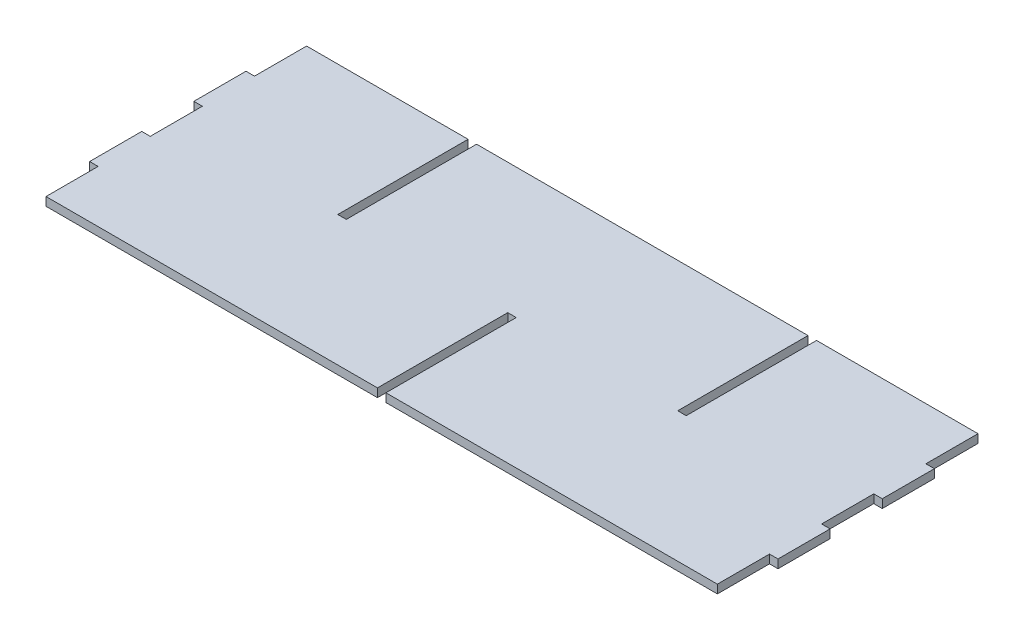
ISO-10303-21;
HEADER;
FILE_DESCRIPTION(('STEP AP214'),'2;1');
FILE_NAME('part.step','',(''),(''),'','','');
FILE_SCHEMA(('AUTOMOTIVE_DESIGN { 1 0 10303 214 1 1 1 1 }'));
ENDSEC;
DATA;
#1=APPLICATION_CONTEXT('core data for automotive mechanical design processes');
#2=APPLICATION_PROTOCOL_DEFINITION('international standard','automotive_design',2000,#1);
#3=PRODUCT_CONTEXT('',#1,'mechanical');
#4=PRODUCT('Part','Part','',(#3));
#5=PRODUCT_RELATED_PRODUCT_CATEGORY('part','',(#4));
#6=PRODUCT_DEFINITION_FORMATION('','',#4);
#7=PRODUCT_DEFINITION_CONTEXT('part definition',#1,'design');
#8=PRODUCT_DEFINITION('design','',#6,#7);
#9=PRODUCT_DEFINITION_SHAPE('','',#8);
#10=(LENGTH_UNIT() NAMED_UNIT(*) SI_UNIT(.MILLI.,.METRE.));
#11=(NAMED_UNIT(*) PLANE_ANGLE_UNIT() SI_UNIT($,.RADIAN.));
#12=(NAMED_UNIT(*) SI_UNIT($,.STERADIAN.) SOLID_ANGLE_UNIT());
#13=UNCERTAINTY_MEASURE_WITH_UNIT(LENGTH_MEASURE(1.E-05),#10,'distance_accuracy_value','');
#14=(GEOMETRIC_REPRESENTATION_CONTEXT(3) GLOBAL_UNCERTAINTY_ASSIGNED_CONTEXT((#13)) GLOBAL_UNIT_ASSIGNED_CONTEXT((#10,
#11,#12)) REPRESENTATION_CONTEXT('',''));
#15=CARTESIAN_POINT('',(0.,0.,0.));
#16=DIRECTION('',(0.,0.,1.));
#17=DIRECTION('',(1.,0.,0.));
#18=AXIS2_PLACEMENT_3D('',#15,#16,#17);
#19=CARTESIAN_POINT('',(118.5,1.5,-27.6));
#20=DIRECTION('',(-1.,0.,0.));
#21=DIRECTION('',(0.,0.,1.));
#22=AXIS2_PLACEMENT_3D('',#19,#20,#21);
#23=PLANE('',#22);
#24=DIRECTION('',(0.,0.,-1.));
#25=VECTOR('',#24,1.);
#26=CARTESIAN_POINT('',(118.5,-1.5,-27.6));
#27=LINE('',#26,#25);
#28=CARTESIAN_POINT('',(118.5,-1.5,-27.6));
#29=VERTEX_POINT('',#28);
#30=CARTESIAN_POINT('',(118.5,-1.5,-46.));
#31=VERTEX_POINT('',#30);
#32=EDGE_CURVE('E273',#29,#31,#27,.T.);
#33=ORIENTED_EDGE('',*,*,#32,.T.);
#34=DIRECTION('',(0.,-1.,0.));
#35=VECTOR('',#34,1.);
#36=CARTESIAN_POINT('',(118.5,1.5,-46.));
#37=LINE('',#36,#35);
#38=CARTESIAN_POINT('',(118.5,1.5,-46.));
#39=VERTEX_POINT('',#38);
#40=EDGE_CURVE('E11',#39,#31,#37,.T.);
#41=ORIENTED_EDGE('',*,*,#40,.F.);
#42=DIRECTION('',(0.,0.,-1.));
#43=VECTOR('',#42,1.);
#44=CARTESIAN_POINT('',(118.5,1.5,-27.6));
#45=LINE('',#44,#43);
#46=CARTESIAN_POINT('',(118.5,1.5,-27.6));
#47=VERTEX_POINT('',#46);
#48=EDGE_CURVE('E335',#47,#39,#45,.T.);
#49=ORIENTED_EDGE('',*,*,#48,.F.);
#50=DIRECTION('',(0.,-1.,0.));
#51=VECTOR('',#50,1.);
#52=CARTESIAN_POINT('',(118.5,1.5,-27.6));
#53=LINE('',#52,#51);
#54=EDGE_CURVE('E269',#47,#29,#53,.T.);
#55=ORIENTED_EDGE('',*,*,#54,.T.);
#56=EDGE_LOOP('',(#33,#41,#49,#55));
#57=FACE_BOUND('',#56,.T.);
#58=ADVANCED_FACE('F33',(#57),#23,.F.);
#59=CARTESIAN_POINT('',(61.5000000000003,1.5,-46.));
#60=DIRECTION('',(0.,0.,1.));
#61=DIRECTION('',(1.,0.,0.));
#62=AXIS2_PLACEMENT_3D('',#59,#60,#61);
#63=PLANE('',#62);
#64=DIRECTION('',(-1.,0.,0.));
#65=VECTOR('',#64,1.);
#66=CARTESIAN_POINT('',(61.5000000000003,-1.5,-46.));
#67=LINE('',#66,#65);
#68=CARTESIAN_POINT('',(61.5000000000003,-1.5,-46.));
#69=VERTEX_POINT('',#68);
#70=EDGE_CURVE('E276',#31,#69,#67,.T.);
#71=ORIENTED_EDGE('',*,*,#70,.T.);
#72=DIRECTION('',(0.,-1.,0.));
#73=VECTOR('',#72,1.);
#74=CARTESIAN_POINT('',(61.5000000000003,1.5,-46.));
#75=LINE('',#74,#73);
#76=CARTESIAN_POINT('',(61.5000000000003,1.5,-46.));
#77=VERTEX_POINT('',#76);
#78=EDGE_CURVE('E41',#77,#69,#75,.T.);
#79=ORIENTED_EDGE('',*,*,#78,.F.);
#80=DIRECTION('',(-1.,0.,0.));
#81=VECTOR('',#80,1.);
#82=CARTESIAN_POINT('',(61.5000000000003,1.5,-46.));
#83=LINE('',#82,#81);
#84=EDGE_CURVE('E164',#39,#77,#83,.T.);
#85=ORIENTED_EDGE('',*,*,#84,.F.);
#86=ORIENTED_EDGE('',*,*,#40,.T.);
#87=EDGE_LOOP('',(#71,#79,#85,#86));
#88=FACE_BOUND('',#87,.T.);
#89=ADVANCED_FACE('F513',(#88),#63,.F.);
#90=CARTESIAN_POINT('',(61.5000000000003,1.5,0.));
#91=DIRECTION('',(1.,0.,0.));
#92=DIRECTION('',(0.,0.,-1.));
#93=AXIS2_PLACEMENT_3D('',#90,#91,#92);
#94=PLANE('',#93);
#95=DIRECTION('',(0.,0.,1.));
#96=VECTOR('',#95,1.);
#97=CARTESIAN_POINT('',(61.5000000000003,-1.5,0.));
#98=LINE('',#97,#96);
#99=CARTESIAN_POINT('',(61.5000000000003,-1.5,0.));
#100=VERTEX_POINT('',#99);
#101=EDGE_CURVE('E278',#69,#100,#98,.T.);
#102=ORIENTED_EDGE('',*,*,#101,.T.);
#103=DIRECTION('',(0.,-1.,0.));
#104=VECTOR('',#103,1.);
#105=CARTESIAN_POINT('',(61.5000000000003,1.5,0.));
#106=LINE('',#105,#104);
#107=CARTESIAN_POINT('',(61.5000000000003,1.5,0.));
#108=VERTEX_POINT('',#107);
#109=EDGE_CURVE('E414',#108,#100,#106,.T.);
#110=ORIENTED_EDGE('',*,*,#109,.F.);
#111=DIRECTION('',(0.,0.,1.));
#112=VECTOR('',#111,1.);
#113=CARTESIAN_POINT('',(61.5000000000003,1.5,0.));
#114=LINE('',#113,#112);
#115=EDGE_CURVE('E422',#77,#108,#114,.T.);
#116=ORIENTED_EDGE('',*,*,#115,.F.);
#117=ORIENTED_EDGE('',*,*,#78,.T.);
#118=EDGE_LOOP('',(#102,#110,#116,#117));
#119=FACE_BOUND('',#118,.T.);
#120=ADVANCED_FACE('F420',(#119),#94,.F.);
#121=CARTESIAN_POINT('',(58.5000000000003,1.5,0.));
#122=DIRECTION('',(0.,0.,1.));
#123=DIRECTION('',(1.,0.,0.));
#124=AXIS2_PLACEMENT_3D('',#121,#122,#123);
#125=PLANE('',#124);
#126=DIRECTION('',(-1.,0.,0.));
#127=VECTOR('',#126,1.);
#128=CARTESIAN_POINT('',(58.5000000000003,-1.5,0.));
#129=LINE('',#128,#127);
#130=CARTESIAN_POINT('',(58.5000000000003,-1.5,0.));
#131=VERTEX_POINT('',#130);
#132=EDGE_CURVE('E280',#100,#131,#129,.T.);
#133=ORIENTED_EDGE('',*,*,#132,.T.);
#134=DIRECTION('',(0.,-1.,0.));
#135=VECTOR('',#134,1.);
#136=CARTESIAN_POINT('',(58.5000000000003,1.5,0.));
#137=LINE('',#136,#135);
#138=CARTESIAN_POINT('',(58.5000000000003,1.5,0.));
#139=VERTEX_POINT('',#138);
#140=EDGE_CURVE('E411',#139,#131,#137,.T.);
#141=ORIENTED_EDGE('',*,*,#140,.F.);
#142=DIRECTION('',(-1.,0.,0.));
#143=VECTOR('',#142,1.);
#144=CARTESIAN_POINT('',(58.5000000000003,1.5,0.));
#145=LINE('',#144,#143);
#146=EDGE_CURVE('E440',#108,#139,#145,.T.);
#147=ORIENTED_EDGE('',*,*,#146,.F.);
#148=ORIENTED_EDGE('',*,*,#109,.T.);
#149=EDGE_LOOP('',(#133,#141,#147,#148));
#150=FACE_BOUND('',#149,.T.);
#151=ADVANCED_FACE('F431',(#150),#125,.F.);
#152=CARTESIAN_POINT('',(58.5000000000003,1.5,-46.));
#153=DIRECTION('',(-1.,0.,0.));
#154=DIRECTION('',(0.,0.,1.));
#155=AXIS2_PLACEMENT_3D('',#152,#153,#154);
#156=PLANE('',#155);
#157=DIRECTION('',(0.,0.,-1.));
#158=VECTOR('',#157,1.);
#159=CARTESIAN_POINT('',(58.5000000000003,-1.5,-46.));
#160=LINE('',#159,#158);
#161=CARTESIAN_POINT('',(58.5000000000003,-1.5,-46.));
#162=VERTEX_POINT('',#161);
#163=EDGE_CURVE('E282',#131,#162,#160,.T.);
#164=ORIENTED_EDGE('',*,*,#163,.T.);
#165=DIRECTION('',(0.,-1.,0.));
#166=VECTOR('',#165,1.);
#167=CARTESIAN_POINT('',(58.5000000000003,1.5,-46.));
#168=LINE('',#167,#166);
#169=CARTESIAN_POINT('',(58.5000000000003,1.5,-46.));
#170=VERTEX_POINT('',#169);
#171=EDGE_CURVE('E408',#170,#162,#168,.T.);
#172=ORIENTED_EDGE('',*,*,#171,.F.);
#173=DIRECTION('',(0.,0.,-1.));
#174=VECTOR('',#173,1.);
#175=CARTESIAN_POINT('',(58.5000000000003,1.5,-46.));
#176=LINE('',#175,#174);
#177=EDGE_CURVE('E437',#139,#170,#176,.T.);
#178=ORIENTED_EDGE('',*,*,#177,.F.);
#179=ORIENTED_EDGE('',*,*,#140,.T.);
#180=EDGE_LOOP('',(#164,#172,#178,#179));
#181=FACE_BOUND('',#180,.T.);
#182=ADVANCED_FACE('F435',(#181),#156,.F.);
#183=CARTESIAN_POINT('',(-58.5000000000001,1.5,-46.));
#184=DIRECTION('',(0.,0.,1.));
#185=DIRECTION('',(1.,0.,0.));
#186=AXIS2_PLACEMENT_3D('',#183,#184,#185);
#187=PLANE('',#186);
#188=DIRECTION('',(-1.,0.,0.));
#189=VECTOR('',#188,1.);
#190=CARTESIAN_POINT('',(-58.5000000000001,-1.5,-46.));
#191=LINE('',#190,#189);
#192=CARTESIAN_POINT('',(-58.5000000000001,-1.5,-46.));
#193=VERTEX_POINT('',#192);
#194=EDGE_CURVE('E284',#162,#193,#191,.T.);
#195=ORIENTED_EDGE('',*,*,#194,.T.);
#196=DIRECTION('',(0.,-1.,0.));
#197=VECTOR('',#196,1.);
#198=CARTESIAN_POINT('',(-58.5000000000001,1.5,-46.));
#199=LINE('',#198,#197);
#200=CARTESIAN_POINT('',(-58.5000000000001,1.5,-46.));
#201=VERTEX_POINT('',#200);
#202=EDGE_CURVE('E405',#201,#193,#199,.T.);
#203=ORIENTED_EDGE('',*,*,#202,.F.);
#204=DIRECTION('',(-1.,0.,0.));
#205=VECTOR('',#204,1.);
#206=CARTESIAN_POINT('',(-58.5000000000001,1.5,-46.));
#207=LINE('',#206,#205);
#208=EDGE_CURVE('E439',#170,#201,#207,.T.);
#209=ORIENTED_EDGE('',*,*,#208,.F.);
#210=ORIENTED_EDGE('',*,*,#171,.T.);
#211=EDGE_LOOP('',(#195,#203,#209,#210));
#212=FACE_BOUND('',#211,.T.);
#213=ADVANCED_FACE('F526',(#212),#187,.F.);
#214=CARTESIAN_POINT('',(-58.5000000000002,1.5,0.));
#215=DIRECTION('',(1.,0.,0.));
#216=DIRECTION('',(0.,0.,-1.));
#217=AXIS2_PLACEMENT_3D('',#214,#215,#216);
#218=PLANE('',#217);
#219=DIRECTION('',(0.,0.,1.));
#220=VECTOR('',#219,1.);
#221=CARTESIAN_POINT('',(-58.5000000000002,-1.5,0.));
#222=LINE('',#221,#220);
#223=CARTESIAN_POINT('',(-58.5000000000002,-1.5,0.));
#224=VERTEX_POINT('',#223);
#225=EDGE_CURVE('E286',#193,#224,#222,.T.);
#226=ORIENTED_EDGE('',*,*,#225,.T.);
#227=DIRECTION('',(0.,-1.,0.));
#228=VECTOR('',#227,1.);
#229=CARTESIAN_POINT('',(-58.5000000000002,1.5,0.));
#230=LINE('',#229,#228);
#231=CARTESIAN_POINT('',(-58.5000000000002,1.5,0.));
#232=VERTEX_POINT('',#231);
#233=EDGE_CURVE('E402',#232,#224,#230,.T.);
#234=ORIENTED_EDGE('',*,*,#233,.F.);
#235=DIRECTION('',(0.,0.,1.));
#236=VECTOR('',#235,1.);
#237=CARTESIAN_POINT('',(-58.5000000000002,1.5,0.));
#238=LINE('',#237,#236);
#239=EDGE_CURVE('E442',#201,#232,#238,.T.);
#240=ORIENTED_EDGE('',*,*,#239,.F.);
#241=ORIENTED_EDGE('',*,*,#202,.T.);
#242=EDGE_LOOP('',(#226,#234,#240,#241));
#243=FACE_BOUND('',#242,.T.);
#244=ADVANCED_FACE('F529',(#243),#218,.F.);
#245=CARTESIAN_POINT('',(-61.5000000000001,1.5,0.));
#246=DIRECTION('',(0.,0.,1.));
#247=DIRECTION('',(1.,0.,0.));
#248=AXIS2_PLACEMENT_3D('',#245,#246,#247);
#249=PLANE('',#248);
#250=DIRECTION('',(-1.,0.,0.));
#251=VECTOR('',#250,1.);
#252=CARTESIAN_POINT('',(-61.5000000000001,-1.5,0.));
#253=LINE('',#252,#251);
#254=CARTESIAN_POINT('',(-61.5000000000001,-1.5,0.));
#255=VERTEX_POINT('',#254);
#256=EDGE_CURVE('E288',#224,#255,#253,.T.);
#257=ORIENTED_EDGE('',*,*,#256,.T.);
#258=DIRECTION('',(0.,-1.,0.));
#259=VECTOR('',#258,1.);
#260=CARTESIAN_POINT('',(-61.5000000000001,1.5,0.));
#261=LINE('',#260,#259);
#262=CARTESIAN_POINT('',(-61.5000000000001,1.5,0.));
#263=VERTEX_POINT('',#262);
#264=EDGE_CURVE('E399',#263,#255,#261,.T.);
#265=ORIENTED_EDGE('',*,*,#264,.F.);
#266=DIRECTION('',(-1.,0.,0.));
#267=VECTOR('',#266,1.);
#268=CARTESIAN_POINT('',(-61.5000000000001,1.5,0.));
#269=LINE('',#268,#267);
#270=EDGE_CURVE('E448',#232,#263,#269,.T.);
#271=ORIENTED_EDGE('',*,*,#270,.F.);
#272=ORIENTED_EDGE('',*,*,#233,.T.);
#273=EDGE_LOOP('',(#257,#265,#271,#272));
#274=FACE_BOUND('',#273,.T.);
#275=ADVANCED_FACE('F533',(#274),#249,.F.);
#276=CARTESIAN_POINT('',(-61.5000000000005,1.5,-46.));
#277=DIRECTION('',(-1.,0.,0.));
#278=DIRECTION('',(0.,0.,1.));
#279=AXIS2_PLACEMENT_3D('',#276,#277,#278);
#280=PLANE('',#279);
#281=DIRECTION('',(0.,0.,-1.));
#282=VECTOR('',#281,1.);
#283=CARTESIAN_POINT('',(-61.5000000000005,-1.5,-46.));
#284=LINE('',#283,#282);
#285=CARTESIAN_POINT('',(-61.5000000000005,-1.5,-46.));
#286=VERTEX_POINT('',#285);
#287=EDGE_CURVE('E290',#255,#286,#284,.T.);
#288=ORIENTED_EDGE('',*,*,#287,.T.);
#289=DIRECTION('',(0.,-1.,0.));
#290=VECTOR('',#289,1.);
#291=CARTESIAN_POINT('',(-61.5000000000005,1.5,-46.));
#292=LINE('',#291,#290);
#293=CARTESIAN_POINT('',(-61.5000000000005,1.5,-46.));
#294=VERTEX_POINT('',#293);
#295=EDGE_CURVE('E396',#294,#286,#292,.T.);
#296=ORIENTED_EDGE('',*,*,#295,.F.);
#297=DIRECTION('',(0.,0.,-1.));
#298=VECTOR('',#297,1.);
#299=CARTESIAN_POINT('',(-61.5000000000005,1.5,-46.));
#300=LINE('',#299,#298);
#301=EDGE_CURVE('E450',#263,#294,#300,.T.);
#302=ORIENTED_EDGE('',*,*,#301,.F.);
#303=ORIENTED_EDGE('',*,*,#264,.T.);
#304=EDGE_LOOP('',(#288,#296,#302,#303));
#305=FACE_BOUND('',#304,.T.);
#306=ADVANCED_FACE('F537',(#305),#280,.F.);
#307=CARTESIAN_POINT('',(-61.5000000000005,1.5,-46.));
#308=DIRECTION('',(0.,0.,1.));
#309=DIRECTION('',(1.,0.,0.));
#310=AXIS2_PLACEMENT_3D('',#307,#308,#309);
#311=PLANE('',#310);
#312=DIRECTION('',(-1.,0.,0.));
#313=VECTOR('',#312,1.);
#314=CARTESIAN_POINT('',(-61.5000000000005,-1.5,-46.));
#315=LINE('',#314,#313);
#316=CARTESIAN_POINT('',(-118.5,-1.5,-46.));
#317=VERTEX_POINT('',#316);
#318=EDGE_CURVE('E292',#286,#317,#315,.T.);
#319=ORIENTED_EDGE('',*,*,#318,.T.);
#320=DIRECTION('',(0.,-1.,0.));
#321=VECTOR('',#320,1.);
#322=CARTESIAN_POINT('',(-118.5,1.5,-46.));
#323=LINE('',#322,#321);
#324=CARTESIAN_POINT('',(-118.5,1.5,-46.));
#325=VERTEX_POINT('',#324);
#326=EDGE_CURVE('E393',#325,#317,#323,.T.);
#327=ORIENTED_EDGE('',*,*,#326,.F.);
#328=DIRECTION('',(-1.,0.,0.));
#329=VECTOR('',#328,1.);
#330=CARTESIAN_POINT('',(-61.5000000000005,1.5,-46.));
#331=LINE('',#330,#329);
#332=EDGE_CURVE('E452',#294,#325,#331,.T.);
#333=ORIENTED_EDGE('',*,*,#332,.F.);
#334=ORIENTED_EDGE('',*,*,#295,.T.);
#335=EDGE_LOOP('',(#319,#327,#333,#334));
#336=FACE_BOUND('',#335,.T.);
#337=ADVANCED_FACE('F541',(#336),#311,.F.);
#338=CARTESIAN_POINT('',(-118.5,1.5,-27.6));
#339=DIRECTION('',(1.,0.,0.));
#340=DIRECTION('',(0.,0.,-1.));
#341=AXIS2_PLACEMENT_3D('',#338,#339,#340);
#342=PLANE('',#341);
#343=DIRECTION('',(0.,0.,1.));
#344=VECTOR('',#343,1.);
#345=CARTESIAN_POINT('',(-118.5,-1.5,-27.6));
#346=LINE('',#345,#344);
#347=CARTESIAN_POINT('',(-118.5,-1.5,-27.6));
#348=VERTEX_POINT('',#347);
#349=EDGE_CURVE('E294',#317,#348,#346,.T.);
#350=ORIENTED_EDGE('',*,*,#349,.T.);
#351=DIRECTION('',(0.,-1.,0.));
#352=VECTOR('',#351,1.);
#353=CARTESIAN_POINT('',(-118.5,1.5,-27.6));
#354=LINE('',#353,#352);
#355=CARTESIAN_POINT('',(-118.5,1.5,-27.6));
#356=VERTEX_POINT('',#355);
#357=EDGE_CURVE('E390',#356,#348,#354,.T.);
#358=ORIENTED_EDGE('',*,*,#357,.F.);
#359=DIRECTION('',(0.,0.,1.));
#360=VECTOR('',#359,1.);
#361=CARTESIAN_POINT('',(-118.5,1.5,-27.6));
#362=LINE('',#361,#360);
#363=EDGE_CURVE('E454',#325,#356,#362,.T.);
#364=ORIENTED_EDGE('',*,*,#363,.F.);
#365=ORIENTED_EDGE('',*,*,#326,.T.);
#366=EDGE_LOOP('',(#350,#358,#364,#365));
#367=FACE_BOUND('',#366,.T.);
#368=ADVANCED_FACE('F545',(#367),#342,.F.);
#369=CARTESIAN_POINT('',(-121.5,1.5,-27.6));
#370=DIRECTION('',(0.,0.,1.));
#371=DIRECTION('',(1.,0.,0.));
#372=AXIS2_PLACEMENT_3D('',#369,#370,#371);
#373=PLANE('',#372);
#374=DIRECTION('',(-1.,0.,0.));
#375=VECTOR('',#374,1.);
#376=CARTESIAN_POINT('',(-121.5,-1.5,-27.6));
#377=LINE('',#376,#375);
#378=CARTESIAN_POINT('',(-121.5,-1.5,-27.6));
#379=VERTEX_POINT('',#378);
#380=EDGE_CURVE('E296',#348,#379,#377,.T.);
#381=ORIENTED_EDGE('',*,*,#380,.T.);
#382=DIRECTION('',(0.,-1.,0.));
#383=VECTOR('',#382,1.);
#384=CARTESIAN_POINT('',(-121.5,1.5,-27.6));
#385=LINE('',#384,#383);
#386=CARTESIAN_POINT('',(-121.5,1.5,-27.6));
#387=VERTEX_POINT('',#386);
#388=EDGE_CURVE('E387',#387,#379,#385,.T.);
#389=ORIENTED_EDGE('',*,*,#388,.F.);
#390=DIRECTION('',(-1.,0.,0.));
#391=VECTOR('',#390,1.);
#392=CARTESIAN_POINT('',(-121.5,1.5,-27.6));
#393=LINE('',#392,#391);
#394=EDGE_CURVE('E456',#356,#387,#393,.T.);
#395=ORIENTED_EDGE('',*,*,#394,.F.);
#396=ORIENTED_EDGE('',*,*,#357,.T.);
#397=EDGE_LOOP('',(#381,#389,#395,#396));
#398=FACE_BOUND('',#397,.T.);
#399=ADVANCED_FACE('F549',(#398),#373,.F.);
#400=CARTESIAN_POINT('',(-121.5,1.5,-9.2));
#401=DIRECTION('',(1.,0.,0.));
#402=DIRECTION('',(0.,0.,-1.));
#403=AXIS2_PLACEMENT_3D('',#400,#401,#402);
#404=PLANE('',#403);
#405=DIRECTION('',(0.,0.,1.));
#406=VECTOR('',#405,1.);
#407=CARTESIAN_POINT('',(-121.5,-1.5,-9.2));
#408=LINE('',#407,#406);
#409=CARTESIAN_POINT('',(-121.5,-1.5,-9.2));
#410=VERTEX_POINT('',#409);
#411=EDGE_CURVE('E298',#379,#410,#408,.T.);
#412=ORIENTED_EDGE('',*,*,#411,.T.);
#413=DIRECTION('',(0.,-1.,0.));
#414=VECTOR('',#413,1.);
#415=CARTESIAN_POINT('',(-121.5,1.5,-9.2));
#416=LINE('',#415,#414);
#417=CARTESIAN_POINT('',(-121.5,1.5,-9.2));
#418=VERTEX_POINT('',#417);
#419=EDGE_CURVE('E384',#418,#410,#416,.T.);
#420=ORIENTED_EDGE('',*,*,#419,.F.);
#421=DIRECTION('',(0.,0.,1.));
#422=VECTOR('',#421,1.);
#423=CARTESIAN_POINT('',(-121.5,1.5,-9.2));
#424=LINE('',#423,#422);
#425=EDGE_CURVE('E458',#387,#418,#424,.T.);
#426=ORIENTED_EDGE('',*,*,#425,.F.);
#427=ORIENTED_EDGE('',*,*,#388,.T.);
#428=EDGE_LOOP('',(#412,#420,#426,#427));
#429=FACE_BOUND('',#428,.T.);
#430=ADVANCED_FACE('F553',(#429),#404,.F.);
#431=CARTESIAN_POINT('',(-118.5,1.5,-9.2));
#432=DIRECTION('',(0.,0.,-1.));
#433=DIRECTION('',(-1.,0.,0.));
#434=AXIS2_PLACEMENT_3D('',#431,#432,#433);
#435=PLANE('',#434);
#436=DIRECTION('',(1.,0.,0.));
#437=VECTOR('',#436,1.);
#438=CARTESIAN_POINT('',(-118.5,-1.5,-9.2));
#439=LINE('',#438,#437);
#440=CARTESIAN_POINT('',(-118.5,-1.5,-9.2));
#441=VERTEX_POINT('',#440);
#442=EDGE_CURVE('E300',#410,#441,#439,.T.);
#443=ORIENTED_EDGE('',*,*,#442,.T.);
#444=DIRECTION('',(0.,-1.,0.));
#445=VECTOR('',#444,1.);
#446=CARTESIAN_POINT('',(-118.5,1.5,-9.2));
#447=LINE('',#446,#445);
#448=CARTESIAN_POINT('',(-118.5,1.5,-9.2));
#449=VERTEX_POINT('',#448);
#450=EDGE_CURVE('E381',#449,#441,#447,.T.);
#451=ORIENTED_EDGE('',*,*,#450,.F.);
#452=DIRECTION('',(1.,0.,0.));
#453=VECTOR('',#452,1.);
#454=CARTESIAN_POINT('',(-118.5,1.5,-9.2));
#455=LINE('',#454,#453);
#456=EDGE_CURVE('E460',#418,#449,#455,.T.);
#457=ORIENTED_EDGE('',*,*,#456,.F.);
#458=ORIENTED_EDGE('',*,*,#419,.T.);
#459=EDGE_LOOP('',(#443,#451,#457,#458));
#460=FACE_BOUND('',#459,.T.);
#461=ADVANCED_FACE('F557',(#460),#435,.F.);
#462=CARTESIAN_POINT('',(-118.5,1.5,9.2));
#463=DIRECTION('',(1.,0.,0.));
#464=DIRECTION('',(0.,0.,-1.));
#465=AXIS2_PLACEMENT_3D('',#462,#463,#464);
#466=PLANE('',#465);
#467=DIRECTION('',(0.,0.,1.));
#468=VECTOR('',#467,1.);
#469=CARTESIAN_POINT('',(-118.5,-1.5,9.2));
#470=LINE('',#469,#468);
#471=CARTESIAN_POINT('',(-118.5,-1.5,9.2));
#472=VERTEX_POINT('',#471);
#473=EDGE_CURVE('E302',#441,#472,#470,.T.);
#474=ORIENTED_EDGE('',*,*,#473,.T.);
#475=DIRECTION('',(0.,-1.,0.));
#476=VECTOR('',#475,1.);
#477=CARTESIAN_POINT('',(-118.5,1.5,9.2));
#478=LINE('',#477,#476);
#479=CARTESIAN_POINT('',(-118.5,1.5,9.2));
#480=VERTEX_POINT('',#479);
#481=EDGE_CURVE('E378',#480,#472,#478,.T.);
#482=ORIENTED_EDGE('',*,*,#481,.F.);
#483=DIRECTION('',(0.,0.,1.));
#484=VECTOR('',#483,1.);
#485=CARTESIAN_POINT('',(-118.5,1.5,9.2));
#486=LINE('',#485,#484);
#487=EDGE_CURVE('E462',#449,#480,#486,.T.);
#488=ORIENTED_EDGE('',*,*,#487,.F.);
#489=ORIENTED_EDGE('',*,*,#450,.T.);
#490=EDGE_LOOP('',(#474,#482,#488,#489));
#491=FACE_BOUND('',#490,.T.);
#492=ADVANCED_FACE('F561',(#491),#466,.F.);
#493=CARTESIAN_POINT('',(-121.5,1.5,9.2));
#494=DIRECTION('',(0.,0.,1.));
#495=DIRECTION('',(1.,0.,0.));
#496=AXIS2_PLACEMENT_3D('',#493,#494,#495);
#497=PLANE('',#496);
#498=DIRECTION('',(-1.,0.,0.));
#499=VECTOR('',#498,1.);
#500=CARTESIAN_POINT('',(-121.5,-1.5,9.2));
#501=LINE('',#500,#499);
#502=CARTESIAN_POINT('',(-121.5,-1.5,9.2));
#503=VERTEX_POINT('',#502);
#504=EDGE_CURVE('E304',#472,#503,#501,.T.);
#505=ORIENTED_EDGE('',*,*,#504,.T.);
#506=DIRECTION('',(0.,-1.,0.));
#507=VECTOR('',#506,1.);
#508=CARTESIAN_POINT('',(-121.5,1.5,9.2));
#509=LINE('',#508,#507);
#510=CARTESIAN_POINT('',(-121.5,1.5,9.2));
#511=VERTEX_POINT('',#510);
#512=EDGE_CURVE('E375',#511,#503,#509,.T.);
#513=ORIENTED_EDGE('',*,*,#512,.F.);
#514=DIRECTION('',(-1.,0.,0.));
#515=VECTOR('',#514,1.);
#516=CARTESIAN_POINT('',(-121.5,1.5,9.2));
#517=LINE('',#516,#515);
#518=EDGE_CURVE('E464',#480,#511,#517,.T.);
#519=ORIENTED_EDGE('',*,*,#518,.F.);
#520=ORIENTED_EDGE('',*,*,#481,.T.);
#521=EDGE_LOOP('',(#505,#513,#519,#520));
#522=FACE_BOUND('',#521,.T.);
#523=ADVANCED_FACE('F565',(#522),#497,.F.);
#524=CARTESIAN_POINT('',(-121.5,1.5,27.6));
#525=DIRECTION('',(1.,0.,0.));
#526=DIRECTION('',(0.,0.,-1.));
#527=AXIS2_PLACEMENT_3D('',#524,#525,#526);
#528=PLANE('',#527);
#529=DIRECTION('',(0.,0.,1.));
#530=VECTOR('',#529,1.);
#531=CARTESIAN_POINT('',(-121.5,-1.5,27.6));
#532=LINE('',#531,#530);
#533=CARTESIAN_POINT('',(-121.5,-1.5,27.6));
#534=VERTEX_POINT('',#533);
#535=EDGE_CURVE('E306',#503,#534,#532,.T.);
#536=ORIENTED_EDGE('',*,*,#535,.T.);
#537=DIRECTION('',(0.,-1.,0.));
#538=VECTOR('',#537,1.);
#539=CARTESIAN_POINT('',(-121.5,1.5,27.6));
#540=LINE('',#539,#538);
#541=CARTESIAN_POINT('',(-121.5,1.5,27.6));
#542=VERTEX_POINT('',#541);
#543=EDGE_CURVE('E372',#542,#534,#540,.T.);
#544=ORIENTED_EDGE('',*,*,#543,.F.);
#545=DIRECTION('',(0.,0.,1.));
#546=VECTOR('',#545,1.);
#547=CARTESIAN_POINT('',(-121.5,1.5,27.6));
#548=LINE('',#547,#546);
#549=EDGE_CURVE('E466',#511,#542,#548,.T.);
#550=ORIENTED_EDGE('',*,*,#549,.F.);
#551=ORIENTED_EDGE('',*,*,#512,.T.);
#552=EDGE_LOOP('',(#536,#544,#550,#551));
#553=FACE_BOUND('',#552,.T.);
#554=ADVANCED_FACE('F569',(#553),#528,.F.);
#555=CARTESIAN_POINT('',(-118.5,1.5,27.6));
#556=DIRECTION('',(0.,0.,-1.));
#557=DIRECTION('',(-1.,0.,0.));
#558=AXIS2_PLACEMENT_3D('',#555,#556,#557);
#559=PLANE('',#558);
#560=DIRECTION('',(1.,0.,0.));
#561=VECTOR('',#560,1.);
#562=CARTESIAN_POINT('',(-118.5,-1.5,27.6));
#563=LINE('',#562,#561);
#564=CARTESIAN_POINT('',(-118.5,-1.5,27.6));
#565=VERTEX_POINT('',#564);
#566=EDGE_CURVE('E308',#534,#565,#563,.T.);
#567=ORIENTED_EDGE('',*,*,#566,.T.);
#568=DIRECTION('',(0.,-1.,0.));
#569=VECTOR('',#568,1.);
#570=CARTESIAN_POINT('',(-118.5,1.5,27.6));
#571=LINE('',#570,#569);
#572=CARTESIAN_POINT('',(-118.5,1.5,27.6));
#573=VERTEX_POINT('',#572);
#574=EDGE_CURVE('E369',#573,#565,#571,.T.);
#575=ORIENTED_EDGE('',*,*,#574,.F.);
#576=DIRECTION('',(1.,0.,0.));
#577=VECTOR('',#576,1.);
#578=CARTESIAN_POINT('',(-118.5,1.5,27.6));
#579=LINE('',#578,#577);
#580=EDGE_CURVE('E468',#542,#573,#579,.T.);
#581=ORIENTED_EDGE('',*,*,#580,.F.);
#582=ORIENTED_EDGE('',*,*,#543,.T.);
#583=EDGE_LOOP('',(#567,#575,#581,#582));
#584=FACE_BOUND('',#583,.T.);
#585=ADVANCED_FACE('F573',(#584),#559,.F.);
#586=CARTESIAN_POINT('',(-118.5,1.5,46.));
#587=DIRECTION('',(1.,0.,0.));
#588=DIRECTION('',(0.,0.,-1.));
#589=AXIS2_PLACEMENT_3D('',#586,#587,#588);
#590=PLANE('',#589);
#591=DIRECTION('',(0.,0.,1.));
#592=VECTOR('',#591,1.);
#593=CARTESIAN_POINT('',(-118.5,-1.5,46.));
#594=LINE('',#593,#592);
#595=CARTESIAN_POINT('',(-118.5,-1.5,46.));
#596=VERTEX_POINT('',#595);
#597=EDGE_CURVE('E310',#565,#596,#594,.T.);
#598=ORIENTED_EDGE('',*,*,#597,.T.);
#599=DIRECTION('',(0.,-1.,0.));
#600=VECTOR('',#599,1.);
#601=CARTESIAN_POINT('',(-118.5,1.5,46.));
#602=LINE('',#601,#600);
#603=CARTESIAN_POINT('',(-118.5,1.5,46.));
#604=VERTEX_POINT('',#603);
#605=EDGE_CURVE('E366',#604,#596,#602,.T.);
#606=ORIENTED_EDGE('',*,*,#605,.F.);
#607=DIRECTION('',(0.,0.,1.));
#608=VECTOR('',#607,1.);
#609=CARTESIAN_POINT('',(-118.5,1.5,46.));
#610=LINE('',#609,#608);
#611=EDGE_CURVE('E470',#573,#604,#610,.T.);
#612=ORIENTED_EDGE('',*,*,#611,.F.);
#613=ORIENTED_EDGE('',*,*,#574,.T.);
#614=EDGE_LOOP('',(#598,#606,#612,#613));
#615=FACE_BOUND('',#614,.T.);
#616=ADVANCED_FACE('F577',(#615),#590,.F.);
#617=CARTESIAN_POINT('',(-118.5,1.5,46.));
#618=DIRECTION('',(0.,0.,-1.));
#619=DIRECTION('',(-1.,0.,0.));
#620=AXIS2_PLACEMENT_3D('',#617,#618,#619);
#621=PLANE('',#620);
#622=DIRECTION('',(1.,0.,0.));
#623=VECTOR('',#622,1.);
#624=CARTESIAN_POINT('',(-118.5,-1.5,46.));
#625=LINE('',#624,#623);
#626=CARTESIAN_POINT('',(-1.49999999999993,-1.5,46.));
#627=VERTEX_POINT('',#626);
#628=EDGE_CURVE('E312',#596,#627,#625,.T.);
#629=ORIENTED_EDGE('',*,*,#628,.T.);
#630=DIRECTION('',(0.,-1.,0.));
#631=VECTOR('',#630,1.);
#632=CARTESIAN_POINT('',(-1.49999999999993,1.5,46.));
#633=LINE('',#632,#631);
#634=CARTESIAN_POINT('',(-1.49999999999993,1.5,46.));
#635=VERTEX_POINT('',#634);
#636=EDGE_CURVE('E363',#635,#627,#633,.T.);
#637=ORIENTED_EDGE('',*,*,#636,.F.);
#638=DIRECTION('',(1.,0.,0.));
#639=VECTOR('',#638,1.);
#640=CARTESIAN_POINT('',(-118.5,1.5,46.));
#641=LINE('',#640,#639);
#642=EDGE_CURVE('E472',#604,#635,#641,.T.);
#643=ORIENTED_EDGE('',*,*,#642,.F.);
#644=ORIENTED_EDGE('',*,*,#605,.T.);
#645=EDGE_LOOP('',(#629,#637,#643,#644));
#646=FACE_BOUND('',#645,.T.);
#647=ADVANCED_FACE('F581',(#646),#621,.F.);
#648=CARTESIAN_POINT('',(-1.49999999999993,1.5,46.));
#649=DIRECTION('',(-1.,0.,0.));
#650=DIRECTION('',(0.,0.,1.));
#651=AXIS2_PLACEMENT_3D('',#648,#649,#650);
#652=PLANE('',#651);
#653=DIRECTION('',(0.,0.,-1.));
#654=VECTOR('',#653,1.);
#655=CARTESIAN_POINT('',(-1.49999999999993,-1.5,46.));
#656=LINE('',#655,#654);
#657=CARTESIAN_POINT('',(-1.49999999999992,-1.5,0.));
#658=VERTEX_POINT('',#657);
#659=EDGE_CURVE('E314',#627,#658,#656,.T.);
#660=ORIENTED_EDGE('',*,*,#659,.T.);
#661=DIRECTION('',(0.,-1.,0.));
#662=VECTOR('',#661,1.);
#663=CARTESIAN_POINT('',(-1.49999999999992,1.5,0.));
#664=LINE('',#663,#662);
#665=CARTESIAN_POINT('',(-1.49999999999992,1.5,0.));
#666=VERTEX_POINT('',#665);
#667=EDGE_CURVE('E360',#666,#658,#664,.T.);
#668=ORIENTED_EDGE('',*,*,#667,.F.);
#669=DIRECTION('',(0.,0.,-1.));
#670=VECTOR('',#669,1.);
#671=CARTESIAN_POINT('',(-1.49999999999993,1.5,46.));
#672=LINE('',#671,#670);
#673=EDGE_CURVE('E474',#635,#666,#672,.T.);
#674=ORIENTED_EDGE('',*,*,#673,.F.);
#675=ORIENTED_EDGE('',*,*,#636,.T.);
#676=EDGE_LOOP('',(#660,#668,#674,#675));
#677=FACE_BOUND('',#676,.T.);
#678=ADVANCED_FACE('F585',(#677),#652,.F.);
#679=CARTESIAN_POINT('',(-1.49999999999992,1.5,0.));
#680=DIRECTION('',(0.,0.,-1.));
#681=DIRECTION('',(-1.,0.,0.));
#682=AXIS2_PLACEMENT_3D('',#679,#680,#681);
#683=PLANE('',#682);
#684=DIRECTION('',(1.,0.,0.));
#685=VECTOR('',#684,1.);
#686=CARTESIAN_POINT('',(-1.49999999999992,-1.5,0.));
#687=LINE('',#686,#685);
#688=CARTESIAN_POINT('',(1.50000000000007,-1.5,0.));
#689=VERTEX_POINT('',#688);
#690=EDGE_CURVE('E316',#658,#689,#687,.T.);
#691=ORIENTED_EDGE('',*,*,#690,.T.);
#692=DIRECTION('',(0.,-1.,0.));
#693=VECTOR('',#692,1.);
#694=CARTESIAN_POINT('',(1.50000000000007,1.5,0.));
#695=LINE('',#694,#693);
#696=CARTESIAN_POINT('',(1.50000000000007,1.5,0.));
#697=VERTEX_POINT('',#696);
#698=EDGE_CURVE('E357',#697,#689,#695,.T.);
#699=ORIENTED_EDGE('',*,*,#698,.F.);
#700=DIRECTION('',(1.,0.,0.));
#701=VECTOR('',#700,1.);
#702=CARTESIAN_POINT('',(-1.49999999999992,1.5,0.));
#703=LINE('',#702,#701);
#704=EDGE_CURVE('E476',#666,#697,#703,.T.);
#705=ORIENTED_EDGE('',*,*,#704,.F.);
#706=ORIENTED_EDGE('',*,*,#667,.T.);
#707=EDGE_LOOP('',(#691,#699,#705,#706));
#708=FACE_BOUND('',#707,.T.);
#709=ADVANCED_FACE('F589',(#708),#683,.F.);
#710=CARTESIAN_POINT('',(1.50000000000007,1.5,0.));
#711=DIRECTION('',(1.,0.,0.));
#712=DIRECTION('',(0.,0.,-1.));
#713=AXIS2_PLACEMENT_3D('',#710,#711,#712);
#714=PLANE('',#713);
#715=DIRECTION('',(0.,0.,1.));
#716=VECTOR('',#715,1.);
#717=CARTESIAN_POINT('',(1.50000000000007,-1.5,0.));
#718=LINE('',#717,#716);
#719=CARTESIAN_POINT('',(1.5000000000001,-1.5,46.));
#720=VERTEX_POINT('',#719);
#721=EDGE_CURVE('E318',#689,#720,#718,.T.);
#722=ORIENTED_EDGE('',*,*,#721,.T.);
#723=DIRECTION('',(0.,-1.,0.));
#724=VECTOR('',#723,1.);
#725=CARTESIAN_POINT('',(1.5000000000001,1.5,46.));
#726=LINE('',#725,#724);
#727=CARTESIAN_POINT('',(1.5000000000001,1.5,46.));
#728=VERTEX_POINT('',#727);
#729=EDGE_CURVE('E354',#728,#720,#726,.T.);
#730=ORIENTED_EDGE('',*,*,#729,.F.);
#731=DIRECTION('',(0.,0.,1.));
#732=VECTOR('',#731,1.);
#733=CARTESIAN_POINT('',(1.50000000000007,1.5,0.));
#734=LINE('',#733,#732);
#735=EDGE_CURVE('E478',#697,#728,#734,.T.);
#736=ORIENTED_EDGE('',*,*,#735,.F.);
#737=ORIENTED_EDGE('',*,*,#698,.T.);
#738=EDGE_LOOP('',(#722,#730,#736,#737));
#739=FACE_BOUND('',#738,.T.);
#740=ADVANCED_FACE('F593',(#739),#714,.F.);
#741=CARTESIAN_POINT('',(1.5000000000001,1.5,46.));
#742=DIRECTION('',(0.,0.,-1.));
#743=DIRECTION('',(-1.,0.,0.));
#744=AXIS2_PLACEMENT_3D('',#741,#742,#743);
#745=PLANE('',#744);
#746=DIRECTION('',(1.,0.,0.));
#747=VECTOR('',#746,1.);
#748=CARTESIAN_POINT('',(1.5000000000001,-1.5,46.));
#749=LINE('',#748,#747);
#750=CARTESIAN_POINT('',(118.5,-1.5,46.));
#751=VERTEX_POINT('',#750);
#752=EDGE_CURVE('E320',#720,#751,#749,.T.);
#753=ORIENTED_EDGE('',*,*,#752,.T.);
#754=DIRECTION('',(0.,-1.,0.));
#755=VECTOR('',#754,1.);
#756=CARTESIAN_POINT('',(118.5,1.5,46.));
#757=LINE('',#756,#755);
#758=CARTESIAN_POINT('',(118.5,1.5,46.));
#759=VERTEX_POINT('',#758);
#760=EDGE_CURVE('E351',#759,#751,#757,.T.);
#761=ORIENTED_EDGE('',*,*,#760,.F.);
#762=DIRECTION('',(1.,0.,0.));
#763=VECTOR('',#762,1.);
#764=CARTESIAN_POINT('',(1.5000000000001,1.5,46.));
#765=LINE('',#764,#763);
#766=EDGE_CURVE('E480',#728,#759,#765,.T.);
#767=ORIENTED_EDGE('',*,*,#766,.F.);
#768=ORIENTED_EDGE('',*,*,#729,.T.);
#769=EDGE_LOOP('',(#753,#761,#767,#768));
#770=FACE_BOUND('',#769,.T.);
#771=ADVANCED_FACE('F597',(#770),#745,.F.);
#772=CARTESIAN_POINT('',(118.5,1.5,46.));
#773=DIRECTION('',(-1.,0.,0.));
#774=DIRECTION('',(0.,0.,1.));
#775=AXIS2_PLACEMENT_3D('',#772,#773,#774);
#776=PLANE('',#775);
#777=DIRECTION('',(0.,0.,-1.));
#778=VECTOR('',#777,1.);
#779=CARTESIAN_POINT('',(118.5,-1.5,46.));
#780=LINE('',#779,#778);
#781=CARTESIAN_POINT('',(118.5,-1.5,27.6));
#782=VERTEX_POINT('',#781);
#783=EDGE_CURVE('E322',#751,#782,#780,.T.);
#784=ORIENTED_EDGE('',*,*,#783,.T.);
#785=DIRECTION('',(0.,-1.,0.));
#786=VECTOR('',#785,1.);
#787=CARTESIAN_POINT('',(118.5,1.5,27.6));
#788=LINE('',#787,#786);
#789=CARTESIAN_POINT('',(118.5,1.5,27.6));
#790=VERTEX_POINT('',#789);
#791=EDGE_CURVE('E348',#790,#782,#788,.T.);
#792=ORIENTED_EDGE('',*,*,#791,.F.);
#793=DIRECTION('',(0.,0.,-1.));
#794=VECTOR('',#793,1.);
#795=CARTESIAN_POINT('',(118.5,1.5,46.));
#796=LINE('',#795,#794);
#797=EDGE_CURVE('E482',#759,#790,#796,.T.);
#798=ORIENTED_EDGE('',*,*,#797,.F.);
#799=ORIENTED_EDGE('',*,*,#760,.T.);
#800=EDGE_LOOP('',(#784,#792,#798,#799));
#801=FACE_BOUND('',#800,.T.);
#802=ADVANCED_FACE('F601',(#801),#776,.F.);
#803=CARTESIAN_POINT('',(118.5,1.5,27.6));
#804=DIRECTION('',(0.,0.,-1.));
#805=DIRECTION('',(-1.,0.,0.));
#806=AXIS2_PLACEMENT_3D('',#803,#804,#805);
#807=PLANE('',#806);
#808=DIRECTION('',(1.,0.,0.));
#809=VECTOR('',#808,1.);
#810=CARTESIAN_POINT('',(118.5,-1.5,27.6));
#811=LINE('',#810,#809);
#812=CARTESIAN_POINT('',(121.5,-1.5,27.6));
#813=VERTEX_POINT('',#812);
#814=EDGE_CURVE('E324',#782,#813,#811,.T.);
#815=ORIENTED_EDGE('',*,*,#814,.T.);
#816=DIRECTION('',(0.,-1.,0.));
#817=VECTOR('',#816,1.);
#818=CARTESIAN_POINT('',(121.5,1.5,27.6));
#819=LINE('',#818,#817);
#820=CARTESIAN_POINT('',(121.5,1.5,27.6));
#821=VERTEX_POINT('',#820);
#822=EDGE_CURVE('E345',#821,#813,#819,.T.);
#823=ORIENTED_EDGE('',*,*,#822,.F.);
#824=DIRECTION('',(1.,0.,0.));
#825=VECTOR('',#824,1.);
#826=CARTESIAN_POINT('',(118.5,1.5,27.6));
#827=LINE('',#826,#825);
#828=EDGE_CURVE('E484',#790,#821,#827,.T.);
#829=ORIENTED_EDGE('',*,*,#828,.F.);
#830=ORIENTED_EDGE('',*,*,#791,.T.);
#831=EDGE_LOOP('',(#815,#823,#829,#830));
#832=FACE_BOUND('',#831,.T.);
#833=ADVANCED_FACE('F605',(#832),#807,.F.);
#834=CARTESIAN_POINT('',(121.5,1.5,27.6));
#835=DIRECTION('',(-1.,0.,0.));
#836=DIRECTION('',(0.,0.,1.));
#837=AXIS2_PLACEMENT_3D('',#834,#835,#836);
#838=PLANE('',#837);
#839=DIRECTION('',(0.,0.,-1.));
#840=VECTOR('',#839,1.);
#841=CARTESIAN_POINT('',(121.5,-1.5,27.6));
#842=LINE('',#841,#840);
#843=CARTESIAN_POINT('',(121.5,-1.5,9.20000000000003));
#844=VERTEX_POINT('',#843);
#845=EDGE_CURVE('E326',#813,#844,#842,.T.);
#846=ORIENTED_EDGE('',*,*,#845,.T.);
#847=DIRECTION('',(0.,-1.,0.));
#848=VECTOR('',#847,1.);
#849=CARTESIAN_POINT('',(121.5,1.5,9.20000000000003));
#850=LINE('',#849,#848);
#851=CARTESIAN_POINT('',(121.5,1.5,9.20000000000003));
#852=VERTEX_POINT('',#851);
#853=EDGE_CURVE('E342',#852,#844,#850,.T.);
#854=ORIENTED_EDGE('',*,*,#853,.F.);
#855=DIRECTION('',(0.,0.,-1.));
#856=VECTOR('',#855,1.);
#857=CARTESIAN_POINT('',(121.5,1.5,27.6));
#858=LINE('',#857,#856);
#859=EDGE_CURVE('E486',#821,#852,#858,.T.);
#860=ORIENTED_EDGE('',*,*,#859,.F.);
#861=ORIENTED_EDGE('',*,*,#822,.T.);
#862=EDGE_LOOP('',(#846,#854,#860,#861));
#863=FACE_BOUND('',#862,.T.);
#864=ADVANCED_FACE('F609',(#863),#838,.F.);
#865=CARTESIAN_POINT('',(121.5,1.5,9.20000000000003));
#866=DIRECTION('',(0.,0.,1.));
#867=DIRECTION('',(1.,0.,0.));
#868=AXIS2_PLACEMENT_3D('',#865,#866,#867);
#869=PLANE('',#868);
#870=DIRECTION('',(-1.,0.,0.));
#871=VECTOR('',#870,1.);
#872=CARTESIAN_POINT('',(121.5,-1.5,9.20000000000003));
#873=LINE('',#872,#871);
#874=CARTESIAN_POINT('',(118.5,-1.5,9.20000000000003));
#875=VERTEX_POINT('',#874);
#876=EDGE_CURVE('E328',#844,#875,#873,.T.);
#877=ORIENTED_EDGE('',*,*,#876,.T.);
#878=DIRECTION('',(0.,-1.,0.));
#879=VECTOR('',#878,1.);
#880=CARTESIAN_POINT('',(118.5,1.5,9.20000000000003));
#881=LINE('',#880,#879);
#882=CARTESIAN_POINT('',(118.5,1.5,9.20000000000003));
#883=VERTEX_POINT('',#882);
#884=EDGE_CURVE('E339',#883,#875,#881,.T.);
#885=ORIENTED_EDGE('',*,*,#884,.F.);
#886=DIRECTION('',(-1.,0.,0.));
#887=VECTOR('',#886,1.);
#888=CARTESIAN_POINT('',(121.5,1.5,9.20000000000003));
#889=LINE('',#888,#887);
#890=EDGE_CURVE('E488',#852,#883,#889,.T.);
#891=ORIENTED_EDGE('',*,*,#890,.F.);
#892=ORIENTED_EDGE('',*,*,#853,.T.);
#893=EDGE_LOOP('',(#877,#885,#891,#892));
#894=FACE_BOUND('',#893,.T.);
#895=ADVANCED_FACE('F494',(#894),#869,.F.);
#896=CARTESIAN_POINT('',(118.5,1.5,9.20000000000003));
#897=DIRECTION('',(-1.,0.,0.));
#898=DIRECTION('',(0.,0.,1.));
#899=AXIS2_PLACEMENT_3D('',#896,#897,#898);
#900=PLANE('',#899);
#901=DIRECTION('',(0.,0.,-1.));
#902=VECTOR('',#901,1.);
#903=CARTESIAN_POINT('',(118.5,-1.5,9.20000000000003));
#904=LINE('',#903,#902);
#905=CARTESIAN_POINT('',(118.5,-1.5,-9.20000000000003));
#906=VERTEX_POINT('',#905);
#907=EDGE_CURVE('E330',#875,#906,#904,.T.);
#908=ORIENTED_EDGE('',*,*,#907,.T.);
#909=DIRECTION('',(0.,-1.,0.));
#910=VECTOR('',#909,1.);
#911=CARTESIAN_POINT('',(118.5,1.5,-9.20000000000003));
#912=LINE('',#911,#910);
#913=CARTESIAN_POINT('',(118.5,1.5,-9.20000000000003));
#914=VERTEX_POINT('',#913);
#915=EDGE_CURVE('E264',#914,#906,#912,.T.);
#916=ORIENTED_EDGE('',*,*,#915,.F.);
#917=DIRECTION('',(0.,0.,-1.));
#918=VECTOR('',#917,1.);
#919=CARTESIAN_POINT('',(118.5,1.5,9.20000000000003));
#920=LINE('',#919,#918);
#921=EDGE_CURVE('E255',#883,#914,#920,.T.);
#922=ORIENTED_EDGE('',*,*,#921,.F.);
#923=ORIENTED_EDGE('',*,*,#884,.T.);
#924=EDGE_LOOP('',(#908,#916,#922,#923));
#925=FACE_BOUND('',#924,.T.);
#926=ADVANCED_FACE('F498',(#925),#900,.F.);
#927=CARTESIAN_POINT('',(118.5,1.5,-9.20000000000003));
#928=DIRECTION('',(0.,0.,-1.));
#929=DIRECTION('',(-1.,0.,0.));
#930=AXIS2_PLACEMENT_3D('',#927,#928,#929);
#931=PLANE('',#930);
#932=DIRECTION('',(1.,0.,0.));
#933=VECTOR('',#932,1.);
#934=CARTESIAN_POINT('',(118.5,-1.5,-9.20000000000003));
#935=LINE('',#934,#933);
#936=CARTESIAN_POINT('',(121.5,-1.5,-9.20000000000003));
#937=VERTEX_POINT('',#936);
#938=EDGE_CURVE('E263',#906,#937,#935,.T.);
#939=ORIENTED_EDGE('',*,*,#938,.T.);
#940=DIRECTION('',(0.,-1.,0.));
#941=VECTOR('',#940,1.);
#942=CARTESIAN_POINT('',(121.5,1.5,-9.20000000000003));
#943=LINE('',#942,#941);
#944=CARTESIAN_POINT('',(121.5,1.5,-9.20000000000003));
#945=VERTEX_POINT('',#944);
#946=EDGE_CURVE('E260',#945,#937,#943,.T.);
#947=ORIENTED_EDGE('',*,*,#946,.F.);
#948=DIRECTION('',(1.,0.,0.));
#949=VECTOR('',#948,1.);
#950=CARTESIAN_POINT('',(118.5,1.5,-9.20000000000003));
#951=LINE('',#950,#949);
#952=EDGE_CURVE('E249',#914,#945,#951,.T.);
#953=ORIENTED_EDGE('',*,*,#952,.F.);
#954=ORIENTED_EDGE('',*,*,#915,.T.);
#955=EDGE_LOOP('',(#939,#947,#953,#954));
#956=FACE_BOUND('',#955,.T.);
#957=ADVANCED_FACE('F261',(#956),#931,.F.);
#958=CARTESIAN_POINT('',(121.5,1.5,-9.20000000000003));
#959=DIRECTION('',(-1.,0.,0.));
#960=DIRECTION('',(0.,0.,1.));
#961=AXIS2_PLACEMENT_3D('',#958,#959,#960);
#962=PLANE('',#961);
#963=DIRECTION('',(0.,0.,-1.));
#964=VECTOR('',#963,1.);
#965=CARTESIAN_POINT('',(121.5,-1.5,-9.20000000000003));
#966=LINE('',#965,#964);
#967=CARTESIAN_POINT('',(121.5,-1.5,-27.6));
#968=VERTEX_POINT('',#967);
#969=EDGE_CURVE('E150',#937,#968,#966,.T.);
#970=ORIENTED_EDGE('',*,*,#969,.T.);
#971=DIRECTION('',(0.,-1.,0.));
#972=VECTOR('',#971,1.);
#973=CARTESIAN_POINT('',(121.5,1.5,-27.6));
#974=LINE('',#973,#972);
#975=CARTESIAN_POINT('',(121.5,1.5,-27.6));
#976=VERTEX_POINT('',#975);
#977=EDGE_CURVE('E265',#976,#968,#974,.T.);
#978=ORIENTED_EDGE('',*,*,#977,.F.);
#979=DIRECTION('',(0.,0.,-1.));
#980=VECTOR('',#979,1.);
#981=CARTESIAN_POINT('',(121.5,1.5,-9.20000000000003));
#982=LINE('',#981,#980);
#983=EDGE_CURVE('E253',#945,#976,#982,.T.);
#984=ORIENTED_EDGE('',*,*,#983,.F.);
#985=ORIENTED_EDGE('',*,*,#946,.T.);
#986=EDGE_LOOP('',(#970,#978,#984,#985));
#987=FACE_BOUND('',#986,.T.);
#988=ADVANCED_FACE('F267',(#987),#962,.F.);
#989=CARTESIAN_POINT('',(121.5,1.5,-27.6));
#990=DIRECTION('',(0.,0.,1.));
#991=DIRECTION('',(1.,0.,0.));
#992=AXIS2_PLACEMENT_3D('',#989,#990,#991);
#993=PLANE('',#992);
#994=DIRECTION('',(-1.,0.,0.));
#995=VECTOR('',#994,1.);
#996=CARTESIAN_POINT('',(121.5,-1.5,-27.6));
#997=LINE('',#996,#995);
#998=EDGE_CURVE('E156',#968,#29,#997,.T.);
#999=ORIENTED_EDGE('',*,*,#998,.T.);
#1000=ORIENTED_EDGE('',*,*,#54,.F.);
#1001=DIRECTION('',(-1.,0.,0.));
#1002=VECTOR('',#1001,1.);
#1003=CARTESIAN_POINT('',(121.5,1.5,-27.6));
#1004=LINE('',#1003,#1002);
#1005=EDGE_CURVE('E49',#976,#47,#1004,.T.);
#1006=ORIENTED_EDGE('',*,*,#1005,.F.);
#1007=ORIENTED_EDGE('',*,*,#977,.T.);
#1008=EDGE_LOOP('',(#999,#1000,#1006,#1007));
#1009=FACE_BOUND('',#1008,.T.);
#1010=ADVANCED_FACE('F502',(#1009),#993,.F.);
#1011=CARTESIAN_POINT('',(0.,1.5,0.));
#1012=DIRECTION('',(0.,-1.,0.));
#1013=DIRECTION('',(0.,0.,-1.));
#1014=AXIS2_PLACEMENT_3D('',#1011,#1012,#1013);
#1015=PLANE('',#1014);
#1016=ORIENTED_EDGE('',*,*,#48,.T.);
#1017=ORIENTED_EDGE('',*,*,#84,.T.);
#1018=ORIENTED_EDGE('',*,*,#115,.T.);
#1019=ORIENTED_EDGE('',*,*,#146,.T.);
#1020=ORIENTED_EDGE('',*,*,#177,.T.);
#1021=ORIENTED_EDGE('',*,*,#208,.T.);
#1022=ORIENTED_EDGE('',*,*,#239,.T.);
#1023=ORIENTED_EDGE('',*,*,#270,.T.);
#1024=ORIENTED_EDGE('',*,*,#301,.T.);
#1025=ORIENTED_EDGE('',*,*,#332,.T.);
#1026=ORIENTED_EDGE('',*,*,#363,.T.);
#1027=ORIENTED_EDGE('',*,*,#394,.T.);
#1028=ORIENTED_EDGE('',*,*,#425,.T.);
#1029=ORIENTED_EDGE('',*,*,#456,.T.);
#1030=ORIENTED_EDGE('',*,*,#487,.T.);
#1031=ORIENTED_EDGE('',*,*,#518,.T.);
#1032=ORIENTED_EDGE('',*,*,#549,.T.);
#1033=ORIENTED_EDGE('',*,*,#580,.T.);
#1034=ORIENTED_EDGE('',*,*,#611,.T.);
#1035=ORIENTED_EDGE('',*,*,#642,.T.);
#1036=ORIENTED_EDGE('',*,*,#673,.T.);
#1037=ORIENTED_EDGE('',*,*,#704,.T.);
#1038=ORIENTED_EDGE('',*,*,#735,.T.);
#1039=ORIENTED_EDGE('',*,*,#766,.T.);
#1040=ORIENTED_EDGE('',*,*,#797,.T.);
#1041=ORIENTED_EDGE('',*,*,#828,.T.);
#1042=ORIENTED_EDGE('',*,*,#859,.T.);
#1043=ORIENTED_EDGE('',*,*,#890,.T.);
#1044=ORIENTED_EDGE('',*,*,#921,.T.);
#1045=ORIENTED_EDGE('',*,*,#952,.T.);
#1046=ORIENTED_EDGE('',*,*,#983,.T.);
#1047=ORIENTED_EDGE('',*,*,#1005,.T.);
#1048=EDGE_LOOP('',(#1016,#1017,#1018,#1019,#1020,#1021,#1022,#1023,#1024,#1025,#1026,#1027,
#1028,#1029,#1030,#1031,#1032,#1033,#1034,#1035,#1036,#1037,#1038,#1039,#1040,#1041,#1042,#1043,
#1044,#1045,#1046,#1047));
#1049=FACE_BOUND('',#1048,.T.);
#1050=ADVANCED_FACE('F251',(#1049),#1015,.F.);
#1051=CARTESIAN_POINT('',(0.,-1.5,0.));
#1052=DIRECTION('',(0.,-1.,0.));
#1053=DIRECTION('',(0.,0.,-1.));
#1054=AXIS2_PLACEMENT_3D('',#1051,#1052,#1053);
#1055=PLANE('',#1054);
#1056=ORIENTED_EDGE('',*,*,#32,.F.);
#1057=ORIENTED_EDGE('',*,*,#998,.F.);
#1058=ORIENTED_EDGE('',*,*,#969,.F.);
#1059=ORIENTED_EDGE('',*,*,#938,.F.);
#1060=ORIENTED_EDGE('',*,*,#907,.F.);
#1061=ORIENTED_EDGE('',*,*,#876,.F.);
#1062=ORIENTED_EDGE('',*,*,#845,.F.);
#1063=ORIENTED_EDGE('',*,*,#814,.F.);
#1064=ORIENTED_EDGE('',*,*,#783,.F.);
#1065=ORIENTED_EDGE('',*,*,#752,.F.);
#1066=ORIENTED_EDGE('',*,*,#721,.F.);
#1067=ORIENTED_EDGE('',*,*,#690,.F.);
#1068=ORIENTED_EDGE('',*,*,#659,.F.);
#1069=ORIENTED_EDGE('',*,*,#628,.F.);
#1070=ORIENTED_EDGE('',*,*,#597,.F.);
#1071=ORIENTED_EDGE('',*,*,#566,.F.);
#1072=ORIENTED_EDGE('',*,*,#535,.F.);
#1073=ORIENTED_EDGE('',*,*,#504,.F.);
#1074=ORIENTED_EDGE('',*,*,#473,.F.);
#1075=ORIENTED_EDGE('',*,*,#442,.F.);
#1076=ORIENTED_EDGE('',*,*,#411,.F.);
#1077=ORIENTED_EDGE('',*,*,#380,.F.);
#1078=ORIENTED_EDGE('',*,*,#349,.F.);
#1079=ORIENTED_EDGE('',*,*,#318,.F.);
#1080=ORIENTED_EDGE('',*,*,#287,.F.);
#1081=ORIENTED_EDGE('',*,*,#256,.F.);
#1082=ORIENTED_EDGE('',*,*,#225,.F.);
#1083=ORIENTED_EDGE('',*,*,#194,.F.);
#1084=ORIENTED_EDGE('',*,*,#163,.F.);
#1085=ORIENTED_EDGE('',*,*,#132,.F.);
#1086=ORIENTED_EDGE('',*,*,#101,.F.);
#1087=ORIENTED_EDGE('',*,*,#70,.F.);
#1088=EDGE_LOOP('',(#1056,#1057,#1058,#1059,#1060,#1061,#1062,#1063,#1064,#1065,#1066,#1067,
#1068,#1069,#1070,#1071,#1072,#1073,#1074,#1075,#1076,#1077,#1078,#1079,#1080,#1081,#1082,#1083,
#1084,#1085,#1086,#1087));
#1089=FACE_BOUND('',#1088,.T.);
#1090=ADVANCED_FACE('F426',(#1089),#1055,.T.);
#1091=CLOSED_SHELL('',(#58,#89,#120,#151,#182,#213,#244,#275,#306,#337,#368,#399,#430,#461,#492,
#523,#554,#585,#616,#647,#678,#709,#740,#771,#802,#833,#864,#895,#926,#957,#988,#1010,#1050,#1090));
#1092=MANIFOLD_SOLID_BREP('B2',#1091);
#1093=ADVANCED_BREP_SHAPE_REPRESENTATION('',(#18,#1092),#14);
#1094=SHAPE_DEFINITION_REPRESENTATION(#9,#1093);
ENDSEC;
END-ISO-10303-21;
